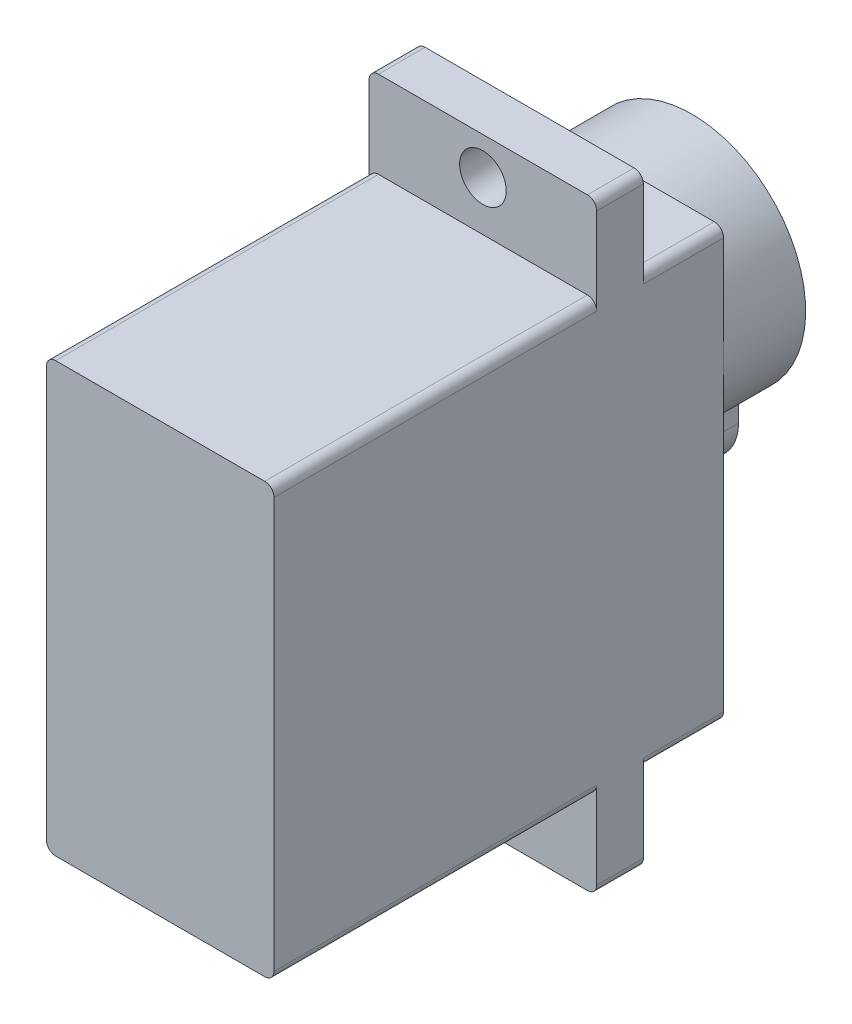
ISO-10303-21;
HEADER;
FILE_DESCRIPTION(('STEP AP214'),'2;1');
FILE_NAME('part.step','',(''),(''),'','','');
FILE_SCHEMA(('AUTOMOTIVE_DESIGN { 1 0 10303 214 1 1 1 1 }'));
ENDSEC;
DATA;
#1=APPLICATION_CONTEXT('core data for automotive mechanical design processes');
#2=APPLICATION_PROTOCOL_DEFINITION('international standard','automotive_design',2000,#1);
#3=PRODUCT_CONTEXT('',#1,'mechanical');
#4=PRODUCT('Part','Part','',(#3));
#5=PRODUCT_RELATED_PRODUCT_CATEGORY('part','',(#4));
#6=PRODUCT_DEFINITION_FORMATION('','',#4);
#7=PRODUCT_DEFINITION_CONTEXT('part definition',#1,'design');
#8=PRODUCT_DEFINITION('design','',#6,#7);
#9=PRODUCT_DEFINITION_SHAPE('','',#8);
#10=(LENGTH_UNIT() NAMED_UNIT(*) SI_UNIT(.MILLI.,.METRE.));
#11=(NAMED_UNIT(*) PLANE_ANGLE_UNIT() SI_UNIT($,.RADIAN.));
#12=(NAMED_UNIT(*) SI_UNIT($,.STERADIAN.) SOLID_ANGLE_UNIT());
#13=UNCERTAINTY_MEASURE_WITH_UNIT(LENGTH_MEASURE(1.E-05),#10,'distance_accuracy_value','');
#14=(GEOMETRIC_REPRESENTATION_CONTEXT(3) GLOBAL_UNCERTAINTY_ASSIGNED_CONTEXT((#13)) GLOBAL_UNIT_ASSIGNED_CONTEXT((#10,
#11,#12)) REPRESENTATION_CONTEXT('',''));
#15=CARTESIAN_POINT('',(0.,0.,0.));
#16=DIRECTION('',(0.,0.,1.));
#17=DIRECTION('',(1.,0.,0.));
#18=AXIS2_PLACEMENT_3D('',#15,#16,#17);
#19=CARTESIAN_POINT('',(5.6,-11.,-12.05));
#20=DIRECTION('',(0.,0.,1.));
#21=DIRECTION('',(1.,0.,0.));
#22=AXIS2_PLACEMENT_3D('',#19,#20,#21);
#23=PLANE('',#22);
#24=CARTESIAN_POINT('',(0.,5.4,-12.05));
#25=DIRECTION('',(0.,0.,-1.));
#26=DIRECTION('',(-1.,0.,0.));
#27=AXIS2_PLACEMENT_3D('',#24,#25,#26);
#28=CIRCLE('',#27,6.1);
#29=CARTESIAN_POINT('',(0.,11.5,-12.05));
#30=VERTEX_POINT('',#29);
#31=CARTESIAN_POINT('',(6.1,5.4,-12.05));
#32=VERTEX_POINT('',#31);
#33=EDGE_CURVE('E444',#30,#32,#28,.T.);
#34=ORIENTED_EDGE('',*,*,#33,.F.);
#35=DIRECTION('',(-1.,0.,0.));
#36=VECTOR('',#35,1.);
#37=CARTESIAN_POINT('',(-5.6,11.5,-12.05));
#38=LINE('',#37,#36);
#39=CARTESIAN_POINT('',(5.59999999999999,11.5,-12.05));
#40=VERTEX_POINT('',#39);
#41=EDGE_CURVE('E397',#40,#30,#38,.T.);
#42=ORIENTED_EDGE('',*,*,#41,.F.);
#43=CARTESIAN_POINT('',(5.6,11.,-12.05));
#44=DIRECTION('',(0.,0.,1.));
#45=DIRECTION('',(-1.,0.,0.));
#46=AXIS2_PLACEMENT_3D('',#43,#44,#45);
#47=CIRCLE('',#46,0.5);
#48=CARTESIAN_POINT('',(6.1,11.,-12.05));
#49=VERTEX_POINT('',#48);
#50=EDGE_CURVE('E393',#49,#40,#47,.T.);
#51=ORIENTED_EDGE('',*,*,#50,.F.);
#52=DIRECTION('',(0.,1.,0.));
#53=VECTOR('',#52,1.);
#54=CARTESIAN_POINT('',(6.1,-11.,-12.05));
#55=LINE('',#54,#53);
#56=EDGE_CURVE('E389',#32,#49,#55,.T.);
#57=ORIENTED_EDGE('',*,*,#56,.F.);
#58=EDGE_LOOP('',(#34,#42,#51,#57));
#59=FACE_BOUND('',#58,.T.);
#60=ADVANCED_FACE('F38',(#59),#23,.F.);
#61=CARTESIAN_POINT('',(2.5,-0.164171097297423,-12.05));
#62=VERTEX_POINT('',#61);
#63=EDGE_CURVE('E448',#32,#62,#28,.T.);
#64=ORIENTED_EDGE('',*,*,#63,.F.);
#65=CARTESIAN_POINT('',(6.1,-11.,-12.05));
#66=VERTEX_POINT('',#65);
#67=EDGE_CURVE('E390',#66,#32,#55,.T.);
#68=ORIENTED_EDGE('',*,*,#67,.F.);
#69=CARTESIAN_POINT('',(5.6,-11.,-12.05));
#70=DIRECTION('',(0.,0.,1.));
#71=DIRECTION('',(1.,0.,0.));
#72=AXIS2_PLACEMENT_3D('',#69,#70,#71);
#73=CIRCLE('',#72,0.5);
#74=CARTESIAN_POINT('',(5.59999999999999,-11.5,-12.05));
#75=VERTEX_POINT('',#74);
#76=EDGE_CURVE('E367',#75,#66,#73,.T.);
#77=ORIENTED_EDGE('',*,*,#76,.F.);
#78=DIRECTION('',(1.,0.,0.));
#79=VECTOR('',#78,1.);
#80=CARTESIAN_POINT('',(-5.6,-11.5,-12.05));
#81=LINE('',#80,#79);
#82=CARTESIAN_POINT('',(-5.6,-11.5,-12.05));
#83=VERTEX_POINT('',#82);
#84=EDGE_CURVE('E372',#83,#75,#81,.T.);
#85=ORIENTED_EDGE('',*,*,#84,.F.);
#86=CARTESIAN_POINT('',(-5.6,-11.,-12.05));
#87=DIRECTION('',(0.,0.,1.));
#88=DIRECTION('',(-1.,0.,0.));
#89=AXIS2_PLACEMENT_3D('',#86,#87,#88);
#90=CIRCLE('',#89,0.5);
#91=CARTESIAN_POINT('',(-6.1,-11.,-12.05));
#92=VERTEX_POINT('',#91);
#93=EDGE_CURVE('E407',#92,#83,#90,.T.);
#94=ORIENTED_EDGE('',*,*,#93,.F.);
#95=DIRECTION('',(0.,-1.,0.));
#96=VECTOR('',#95,1.);
#97=CARTESIAN_POINT('',(-6.1,-11.,-12.05));
#98=LINE('',#97,#96);
#99=CARTESIAN_POINT('',(-6.1,5.4,-12.05));
#100=VERTEX_POINT('',#99);
#101=EDGE_CURVE('E403',#100,#92,#98,.T.);
#102=ORIENTED_EDGE('',*,*,#101,.F.);
#103=CARTESIAN_POINT('',(-2.5,-0.164171097297423,-12.05));
#104=VERTEX_POINT('',#103);
#105=EDGE_CURVE('E450',#104,#100,#28,.T.);
#106=ORIENTED_EDGE('',*,*,#105,.F.);
#107=DIRECTION('',(0.,1.,0.));
#108=VECTOR('',#107,1.);
#109=CARTESIAN_POINT('',(-2.5,-1.6,-12.05));
#110=LINE('',#109,#108);
#111=CARTESIAN_POINT('',(-2.5,-1.6,-12.05));
#112=VERTEX_POINT('',#111);
#113=EDGE_CURVE('E456',#112,#104,#110,.T.);
#114=ORIENTED_EDGE('',*,*,#113,.F.);
#115=CARTESIAN_POINT('',(0.,-1.6,-12.05));
#116=DIRECTION('',(0.,0.,-1.));
#117=DIRECTION('',(-1.,0.,0.));
#118=AXIS2_PLACEMENT_3D('',#115,#116,#117);
#119=CIRCLE('',#118,2.5);
#120=CARTESIAN_POINT('',(2.5,-1.6,-12.05));
#121=VERTEX_POINT('',#120);
#122=EDGE_CURVE('E59',#121,#112,#119,.T.);
#123=ORIENTED_EDGE('',*,*,#122,.F.);
#124=DIRECTION('',(0.,-1.,0.));
#125=VECTOR('',#124,1.);
#126=CARTESIAN_POINT('',(2.5,-1.6,-12.05));
#127=LINE('',#126,#125);
#128=EDGE_CURVE('E54',#62,#121,#127,.T.);
#129=ORIENTED_EDGE('',*,*,#128,.F.);
#130=EDGE_LOOP('',(#64,#68,#77,#85,#94,#102,#106,#114,#123,#129));
#131=FACE_BOUND('',#130,.T.);
#132=ADVANCED_FACE('F465',(#131),#23,.F.);
#133=EDGE_CURVE('E442',#100,#30,#28,.T.);
#134=ORIENTED_EDGE('',*,*,#133,.F.);
#135=CARTESIAN_POINT('',(-6.1,11.,-12.05));
#136=VERTEX_POINT('',#135);
#137=EDGE_CURVE('E404',#136,#100,#98,.T.);
#138=ORIENTED_EDGE('',*,*,#137,.F.);
#139=CARTESIAN_POINT('',(-5.6,11.,-12.05));
#140=DIRECTION('',(0.,0.,1.));
#141=DIRECTION('',(-1.,0.,0.));
#142=AXIS2_PLACEMENT_3D('',#139,#140,#141);
#143=CIRCLE('',#142,0.5);
#144=CARTESIAN_POINT('',(-5.6,11.5,-12.05));
#145=VERTEX_POINT('',#144);
#146=EDGE_CURVE('E400',#145,#136,#143,.T.);
#147=ORIENTED_EDGE('',*,*,#146,.F.);
#148=EDGE_CURVE('E396',#30,#145,#38,.T.);
#149=ORIENTED_EDGE('',*,*,#148,.F.);
#150=EDGE_LOOP('',(#134,#138,#147,#149));
#151=FACE_BOUND('',#150,.T.);
#152=ADVANCED_FACE('F462',(#151),#23,.F.);
#153=CARTESIAN_POINT('',(5.6,-11.,12.05));
#154=DIRECTION('',(0.,0.,-1.));
#155=DIRECTION('',(-1.,0.,0.));
#156=AXIS2_PLACEMENT_3D('',#153,#154,#155);
#157=CYLINDRICAL_SURFACE('',#156,0.5);
#158=CARTESIAN_POINT('',(5.6,-11.,-5.25));
#159=DIRECTION('',(0.,0.,-1.));
#160=DIRECTION('',(-1.,0.,0.));
#161=AXIS2_PLACEMENT_3D('',#158,#159,#160);
#162=CIRCLE('',#161,0.5);
#163=CARTESIAN_POINT('',(6.1,-11.,-5.25));
#164=VERTEX_POINT('',#163);
#165=CARTESIAN_POINT('',(5.59999999999999,-11.5,-5.25));
#166=VERTEX_POINT('',#165);
#167=EDGE_CURVE('E279',#164,#166,#162,.T.);
#168=ORIENTED_EDGE('',*,*,#167,.F.);
#169=DIRECTION('',(0.,0.,-1.));
#170=VECTOR('',#169,1.);
#171=CARTESIAN_POINT('',(6.1,-11.,12.05));
#172=LINE('',#171,#170);
#173=CARTESIAN_POINT('',(6.1,-11.,12.05));
#174=VERTEX_POINT('',#173);
#175=EDGE_CURVE('E440',#174,#164,#172,.T.);
#176=ORIENTED_EDGE('',*,*,#175,.F.);
#177=CARTESIAN_POINT('',(5.6,-11.,12.05));
#178=DIRECTION('',(0.,0.,1.));
#179=DIRECTION('',(1.,0.,0.));
#180=AXIS2_PLACEMENT_3D('',#177,#178,#179);
#181=CIRCLE('',#180,0.5);
#182=CARTESIAN_POINT('',(5.59999999999999,-11.5,12.05));
#183=VERTEX_POINT('',#182);
#184=EDGE_CURVE('E368',#183,#174,#181,.T.);
#185=ORIENTED_EDGE('',*,*,#184,.F.);
#186=DIRECTION('',(0.,0.,-1.));
#187=VECTOR('',#186,1.);
#188=CARTESIAN_POINT('',(5.59999999999999,-11.5,12.05));
#189=LINE('',#188,#187);
#190=EDGE_CURVE('E412',#183,#166,#189,.T.);
#191=ORIENTED_EDGE('',*,*,#190,.T.);
#192=EDGE_LOOP('',(#168,#176,#185,#191));
#193=FACE_BOUND('',#192,.T.);
#194=ADVANCED_FACE('F576',(#193),#157,.T.);
#195=CARTESIAN_POINT('',(-5.6,-11.,12.05));
#196=DIRECTION('',(0.,0.,-1.));
#197=DIRECTION('',(-1.,0.,0.));
#198=AXIS2_PLACEMENT_3D('',#195,#196,#197);
#199=CYLINDRICAL_SURFACE('',#198,0.5);
#200=CARTESIAN_POINT('',(-5.6,-11.,-5.25));
#201=DIRECTION('',(0.,0.,-1.));
#202=DIRECTION('',(-1.,0.,0.));
#203=AXIS2_PLACEMENT_3D('',#200,#201,#202);
#204=CIRCLE('',#203,0.5);
#205=CARTESIAN_POINT('',(-5.6,-11.5,-5.25));
#206=VERTEX_POINT('',#205);
#207=CARTESIAN_POINT('',(-6.1,-11.,-5.25));
#208=VERTEX_POINT('',#207);
#209=EDGE_CURVE('E265',#206,#208,#204,.T.);
#210=ORIENTED_EDGE('',*,*,#209,.F.);
#211=DIRECTION('',(0.,0.,-1.));
#212=VECTOR('',#211,1.);
#213=CARTESIAN_POINT('',(-5.6,-11.5,12.05));
#214=LINE('',#213,#212);
#215=CARTESIAN_POINT('',(-5.6,-11.5,12.05));
#216=VERTEX_POINT('',#215);
#217=EDGE_CURVE('E416',#216,#206,#214,.T.);
#218=ORIENTED_EDGE('',*,*,#217,.F.);
#219=CARTESIAN_POINT('',(-5.6,-11.,12.05));
#220=DIRECTION('',(0.,0.,1.));
#221=DIRECTION('',(-1.,0.,0.));
#222=AXIS2_PLACEMENT_3D('',#219,#220,#221);
#223=CIRCLE('',#222,0.5);
#224=CARTESIAN_POINT('',(-6.1,-11.,12.05));
#225=VERTEX_POINT('',#224);
#226=EDGE_CURVE('E382',#225,#216,#223,.T.);
#227=ORIENTED_EDGE('',*,*,#226,.F.);
#228=DIRECTION('',(0.,0.,-1.));
#229=VECTOR('',#228,1.);
#230=CARTESIAN_POINT('',(-6.1,-11.,12.05));
#231=LINE('',#230,#229);
#232=EDGE_CURVE('E420',#225,#208,#231,.T.);
#233=ORIENTED_EDGE('',*,*,#232,.T.);
#234=EDGE_LOOP('',(#210,#218,#227,#233));
#235=FACE_BOUND('',#234,.T.);
#236=ADVANCED_FACE('F531',(#235),#199,.T.);
#237=CARTESIAN_POINT('',(-5.6,-11.5,12.05));
#238=DIRECTION('',(0.,1.,0.));
#239=DIRECTION('',(0.,0.,1.));
#240=AXIS2_PLACEMENT_3D('',#237,#238,#239);
#241=PLANE('',#240);
#242=DIRECTION('',(-1.,0.,0.));
#243=VECTOR('',#242,1.);
#244=CARTESIAN_POINT('',(5.59999999999999,-11.5,-5.25));
#245=LINE('',#244,#243);
#246=EDGE_CURVE('E281',#166,#206,#245,.T.);
#247=ORIENTED_EDGE('',*,*,#246,.F.);
#248=ORIENTED_EDGE('',*,*,#190,.F.);
#249=DIRECTION('',(1.,0.,0.));
#250=VECTOR('',#249,1.);
#251=CARTESIAN_POINT('',(-5.6,-11.5,12.05));
#252=LINE('',#251,#250);
#253=EDGE_CURVE('E384',#216,#183,#252,.T.);
#254=ORIENTED_EDGE('',*,*,#253,.F.);
#255=ORIENTED_EDGE('',*,*,#217,.T.);
#256=EDGE_LOOP('',(#247,#248,#254,#255));
#257=FACE_BOUND('',#256,.T.);
#258=ADVANCED_FACE('F579',(#257),#241,.F.);
#259=CARTESIAN_POINT('',(5.6,11.,12.05));
#260=DIRECTION('',(0.,0.,-1.));
#261=DIRECTION('',(-1.,0.,0.));
#262=AXIS2_PLACEMENT_3D('',#259,#260,#261);
#263=CYLINDRICAL_SURFACE('',#262,0.5);
#264=CARTESIAN_POINT('',(5.6,11.,-7.75));
#265=DIRECTION('',(0.,0.,-1.));
#266=DIRECTION('',(1.,0.,0.));
#267=AXIS2_PLACEMENT_3D('',#264,#265,#266);
#268=CIRCLE('',#267,0.5);
#269=CARTESIAN_POINT('',(5.59999999999999,11.5,-7.75));
#270=VERTEX_POINT('',#269);
#271=CARTESIAN_POINT('',(6.1,11.,-7.75));
#272=VERTEX_POINT('',#271);
#273=EDGE_CURVE('E316',#270,#272,#268,.T.);
#274=ORIENTED_EDGE('',*,*,#273,.T.);
#275=DIRECTION('',(0.,0.,-1.));
#276=VECTOR('',#275,1.);
#277=CARTESIAN_POINT('',(6.1,11.,12.05));
#278=LINE('',#277,#276);
#279=EDGE_CURVE('E435',#272,#49,#278,.T.);
#280=ORIENTED_EDGE('',*,*,#279,.T.);
#281=ORIENTED_EDGE('',*,*,#50,.T.);
#282=DIRECTION('',(0.,0.,-1.));
#283=VECTOR('',#282,1.);
#284=CARTESIAN_POINT('',(5.59999999999999,11.5,12.05));
#285=LINE('',#284,#283);
#286=EDGE_CURVE('E431',#270,#40,#285,.T.);
#287=ORIENTED_EDGE('',*,*,#286,.F.);
#288=EDGE_LOOP('',(#274,#280,#281,#287));
#289=FACE_BOUND('',#288,.T.);
#290=ADVANCED_FACE('F561',(#289),#263,.T.);
#291=CARTESIAN_POINT('',(-5.6,11.5,12.05));
#292=DIRECTION('',(0.,-1.,0.));
#293=DIRECTION('',(0.,0.,-1.));
#294=AXIS2_PLACEMENT_3D('',#291,#292,#293);
#295=PLANE('',#294);
#296=DIRECTION('',(1.,0.,0.));
#297=VECTOR('',#296,1.);
#298=CARTESIAN_POINT('',(5.59999999999999,11.5,-7.75));
#299=LINE('',#298,#297);
#300=CARTESIAN_POINT('',(-5.6,11.5,-7.75));
#301=VERTEX_POINT('',#300);
#302=EDGE_CURVE('E323',#301,#270,#299,.T.);
#303=ORIENTED_EDGE('',*,*,#302,.T.);
#304=ORIENTED_EDGE('',*,*,#286,.T.);
#305=ORIENTED_EDGE('',*,*,#41,.T.);
#306=ORIENTED_EDGE('',*,*,#148,.T.);
#307=DIRECTION('',(0.,0.,-1.));
#308=VECTOR('',#307,1.);
#309=CARTESIAN_POINT('',(-5.6,11.5,12.05));
#310=LINE('',#309,#308);
#311=EDGE_CURVE('E427',#301,#145,#310,.T.);
#312=ORIENTED_EDGE('',*,*,#311,.F.);
#313=EDGE_LOOP('',(#303,#304,#305,#306,#312));
#314=FACE_BOUND('',#313,.T.);
#315=ADVANCED_FACE('F478',(#314),#295,.F.);
#316=CARTESIAN_POINT('',(-5.6,11.,12.05));
#317=DIRECTION('',(0.,0.,-1.));
#318=DIRECTION('',(-1.,0.,0.));
#319=AXIS2_PLACEMENT_3D('',#316,#317,#318);
#320=CYLINDRICAL_SURFACE('',#319,0.5);
#321=CARTESIAN_POINT('',(-5.6,11.,-7.75));
#322=DIRECTION('',(0.,0.,-1.));
#323=DIRECTION('',(1.,0.,0.));
#324=AXIS2_PLACEMENT_3D('',#321,#322,#323);
#325=CIRCLE('',#324,0.5);
#326=CARTESIAN_POINT('',(-6.1,11.,-7.75));
#327=VERTEX_POINT('',#326);
#328=EDGE_CURVE('E351',#327,#301,#325,.T.);
#329=ORIENTED_EDGE('',*,*,#328,.T.);
#330=ORIENTED_EDGE('',*,*,#311,.T.);
#331=ORIENTED_EDGE('',*,*,#146,.T.);
#332=DIRECTION('',(0.,0.,-1.));
#333=VECTOR('',#332,1.);
#334=CARTESIAN_POINT('',(-6.1,11.,12.05));
#335=LINE('',#334,#333);
#336=EDGE_CURVE('E423',#327,#136,#335,.T.);
#337=ORIENTED_EDGE('',*,*,#336,.F.);
#338=EDGE_LOOP('',(#329,#330,#331,#337));
#339=FACE_BOUND('',#338,.T.);
#340=ADVANCED_FACE('F475',(#339),#320,.T.);
#341=CARTESIAN_POINT('',(6.1,-11.,-7.75));
#342=VERTEX_POINT('',#341);
#343=EDGE_CURVE('E439',#342,#66,#172,.T.);
#344=ORIENTED_EDGE('',*,*,#343,.F.);
#345=CARTESIAN_POINT('',(5.6,-11.,-7.75));
#346=DIRECTION('',(0.,0.,-1.));
#347=DIRECTION('',(-1.,0.,0.));
#348=AXIS2_PLACEMENT_3D('',#345,#346,#347);
#349=CIRCLE('',#348,0.5);
#350=CARTESIAN_POINT('',(5.59999999999999,-11.5,-7.75));
#351=VERTEX_POINT('',#350);
#352=EDGE_CURVE('E296',#342,#351,#349,.T.);
#353=ORIENTED_EDGE('',*,*,#352,.T.);
#354=EDGE_CURVE('E386',#351,#75,#189,.T.);
#355=ORIENTED_EDGE('',*,*,#354,.T.);
#356=ORIENTED_EDGE('',*,*,#76,.T.);
#357=EDGE_LOOP('',(#344,#353,#355,#356));
#358=FACE_BOUND('',#357,.T.);
#359=ADVANCED_FACE('F492',(#358),#157,.T.);
#360=CARTESIAN_POINT('',(6.1,-11.,12.05));
#361=DIRECTION('',(-1.,0.,0.));
#362=DIRECTION('',(0.,0.,1.));
#363=AXIS2_PLACEMENT_3D('',#360,#361,#362);
#364=PLANE('',#363);
#365=ORIENTED_EDGE('',*,*,#67,.T.);
#366=ORIENTED_EDGE('',*,*,#56,.T.);
#367=ORIENTED_EDGE('',*,*,#279,.F.);
#368=DIRECTION('',(0.,1.,0.));
#369=VECTOR('',#368,1.);
#370=CARTESIAN_POINT('',(6.1,11.,-7.75));
#371=LINE('',#370,#369);
#372=CARTESIAN_POINT('',(6.1,15.65,-7.75));
#373=VERTEX_POINT('',#372);
#374=EDGE_CURVE('E340',#272,#373,#371,.T.);
#375=ORIENTED_EDGE('',*,*,#374,.T.);
#376=DIRECTION('',(0.,0.,-1.));
#377=VECTOR('',#376,1.);
#378=CARTESIAN_POINT('',(6.1,15.65,-5.25));
#379=LINE('',#378,#377);
#380=CARTESIAN_POINT('',(6.1,15.65,-5.25));
#381=VERTEX_POINT('',#380);
#382=EDGE_CURVE('E364',#381,#373,#379,.T.);
#383=ORIENTED_EDGE('',*,*,#382,.F.);
#384=DIRECTION('',(0.,1.,0.));
#385=VECTOR('',#384,1.);
#386=CARTESIAN_POINT('',(6.1,11.,-5.25));
#387=LINE('',#386,#385);
#388=CARTESIAN_POINT('',(6.1,11.,-5.25));
#389=VERTEX_POINT('',#388);
#390=EDGE_CURVE('E322',#389,#381,#387,.T.);
#391=ORIENTED_EDGE('',*,*,#390,.F.);
#392=CARTESIAN_POINT('',(6.1,11.,12.05));
#393=VERTEX_POINT('',#392);
#394=EDGE_CURVE('E436',#393,#389,#278,.T.);
#395=ORIENTED_EDGE('',*,*,#394,.F.);
#396=DIRECTION('',(0.,1.,0.));
#397=VECTOR('',#396,1.);
#398=CARTESIAN_POINT('',(6.1,-11.,12.05));
#399=LINE('',#398,#397);
#400=EDGE_CURVE('E371',#174,#393,#399,.T.);
#401=ORIENTED_EDGE('',*,*,#400,.F.);
#402=ORIENTED_EDGE('',*,*,#175,.T.);
#403=DIRECTION('',(0.,1.,0.));
#404=VECTOR('',#403,1.);
#405=CARTESIAN_POINT('',(6.1,-11.,-5.25));
#406=LINE('',#405,#404);
#407=CARTESIAN_POINT('',(6.1,-15.65,-5.25));
#408=VERTEX_POINT('',#407);
#409=EDGE_CURVE('E277',#408,#164,#406,.T.);
#410=ORIENTED_EDGE('',*,*,#409,.F.);
#411=DIRECTION('',(0.,0.,-1.));
#412=VECTOR('',#411,1.);
#413=CARTESIAN_POINT('',(6.1,-15.65,-5.25));
#414=LINE('',#413,#412);
#415=CARTESIAN_POINT('',(6.1,-15.65,-7.75));
#416=VERTEX_POINT('',#415);
#417=EDGE_CURVE('E283',#408,#416,#414,.T.);
#418=ORIENTED_EDGE('',*,*,#417,.T.);
#419=DIRECTION('',(0.,1.,0.));
#420=VECTOR('',#419,1.);
#421=CARTESIAN_POINT('',(6.1,-11.,-7.75));
#422=LINE('',#421,#420);
#423=EDGE_CURVE('E294',#416,#342,#422,.T.);
#424=ORIENTED_EDGE('',*,*,#423,.T.);
#425=ORIENTED_EDGE('',*,*,#343,.T.);
#426=EDGE_LOOP('',(#365,#366,#367,#375,#383,#391,#395,#401,#402,#410,#418,#424,#425));
#427=FACE_BOUND('',#426,.T.);
#428=ADVANCED_FACE('F488',(#427),#364,.F.);
#429=ORIENTED_EDGE('',*,*,#394,.T.);
#430=CARTESIAN_POINT('',(5.6,11.,-5.25));
#431=DIRECTION('',(0.,0.,-1.));
#432=DIRECTION('',(1.,0.,0.));
#433=AXIS2_PLACEMENT_3D('',#430,#431,#432);
#434=CIRCLE('',#433,0.5);
#435=CARTESIAN_POINT('',(5.59999999999999,11.5,-5.25));
#436=VERTEX_POINT('',#435);
#437=EDGE_CURVE('E319',#436,#389,#434,.T.);
#438=ORIENTED_EDGE('',*,*,#437,.F.);
#439=CARTESIAN_POINT('',(5.59999999999999,11.5,12.05));
#440=VERTEX_POINT('',#439);
#441=EDGE_CURVE('E432',#440,#436,#285,.T.);
#442=ORIENTED_EDGE('',*,*,#441,.F.);
#443=CARTESIAN_POINT('',(5.6,11.,12.05));
#444=DIRECTION('',(0.,0.,1.));
#445=DIRECTION('',(-1.,0.,0.));
#446=AXIS2_PLACEMENT_3D('',#443,#444,#445);
#447=CIRCLE('',#446,0.5);
#448=EDGE_CURVE('E374',#393,#440,#447,.T.);
#449=ORIENTED_EDGE('',*,*,#448,.F.);
#450=EDGE_LOOP('',(#429,#438,#442,#449));
#451=FACE_BOUND('',#450,.T.);
#452=ADVANCED_FACE('F572',(#451),#263,.T.);
#453=ORIENTED_EDGE('',*,*,#441,.T.);
#454=DIRECTION('',(1.,0.,0.));
#455=VECTOR('',#454,1.);
#456=CARTESIAN_POINT('',(5.59999999999999,11.5,-5.25));
#457=LINE('',#456,#455);
#458=CARTESIAN_POINT('',(-5.6,11.5,-5.25));
#459=VERTEX_POINT('',#458);
#460=EDGE_CURVE('E335',#459,#436,#457,.T.);
#461=ORIENTED_EDGE('',*,*,#460,.F.);
#462=CARTESIAN_POINT('',(-5.6,11.5,12.05));
#463=VERTEX_POINT('',#462);
#464=EDGE_CURVE('E428',#463,#459,#310,.T.);
#465=ORIENTED_EDGE('',*,*,#464,.F.);
#466=DIRECTION('',(-1.,0.,0.));
#467=VECTOR('',#466,1.);
#468=CARTESIAN_POINT('',(-5.6,11.5,12.05));
#469=LINE('',#468,#467);
#470=EDGE_CURVE('E376',#440,#463,#469,.T.);
#471=ORIENTED_EDGE('',*,*,#470,.F.);
#472=EDGE_LOOP('',(#453,#461,#465,#471));
#473=FACE_BOUND('',#472,.T.);
#474=ADVANCED_FACE('F612',(#473),#295,.F.);
#475=ORIENTED_EDGE('',*,*,#464,.T.);
#476=CARTESIAN_POINT('',(-5.6,11.,-5.25));
#477=DIRECTION('',(0.,0.,-1.));
#478=DIRECTION('',(1.,0.,0.));
#479=AXIS2_PLACEMENT_3D('',#476,#477,#478);
#480=CIRCLE('',#479,0.5);
#481=CARTESIAN_POINT('',(-6.1,11.,-5.25));
#482=VERTEX_POINT('',#481);
#483=EDGE_CURVE('E333',#482,#459,#480,.T.);
#484=ORIENTED_EDGE('',*,*,#483,.F.);
#485=CARTESIAN_POINT('',(-6.1,11.,12.05));
#486=VERTEX_POINT('',#485);
#487=EDGE_CURVE('E424',#486,#482,#335,.T.);
#488=ORIENTED_EDGE('',*,*,#487,.F.);
#489=CARTESIAN_POINT('',(-5.6,11.,12.05));
#490=DIRECTION('',(0.,0.,1.));
#491=DIRECTION('',(-1.,0.,0.));
#492=AXIS2_PLACEMENT_3D('',#489,#490,#491);
#493=CIRCLE('',#492,0.5);
#494=EDGE_CURVE('E378',#463,#486,#493,.T.);
#495=ORIENTED_EDGE('',*,*,#494,.F.);
#496=EDGE_LOOP('',(#475,#484,#488,#495));
#497=FACE_BOUND('',#496,.T.);
#498=ADVANCED_FACE('F542',(#497),#320,.T.);
#499=CARTESIAN_POINT('',(-6.1,-11.,12.05));
#500=DIRECTION('',(1.,0.,0.));
#501=DIRECTION('',(0.,0.,-1.));
#502=AXIS2_PLACEMENT_3D('',#499,#500,#501);
#503=PLANE('',#502);
#504=ORIENTED_EDGE('',*,*,#137,.T.);
#505=ORIENTED_EDGE('',*,*,#101,.T.);
#506=CARTESIAN_POINT('',(-6.1,-11.,-7.75));
#507=VERTEX_POINT('',#506);
#508=EDGE_CURVE('E419',#507,#92,#231,.T.);
#509=ORIENTED_EDGE('',*,*,#508,.F.);
#510=DIRECTION('',(0.,-1.,0.));
#511=VECTOR('',#510,1.);
#512=CARTESIAN_POINT('',(-6.1,-11.,-7.75));
#513=LINE('',#512,#511);
#514=CARTESIAN_POINT('',(-6.1,-15.65,-7.75));
#515=VERTEX_POINT('',#514);
#516=EDGE_CURVE('E286',#507,#515,#513,.T.);
#517=ORIENTED_EDGE('',*,*,#516,.T.);
#518=DIRECTION('',(0.,0.,-1.));
#519=VECTOR('',#518,1.);
#520=CARTESIAN_POINT('',(-6.1,-15.65,-5.25));
#521=LINE('',#520,#519);
#522=CARTESIAN_POINT('',(-6.1,-15.65,-5.25));
#523=VERTEX_POINT('',#522);
#524=EDGE_CURVE('E309',#523,#515,#521,.T.);
#525=ORIENTED_EDGE('',*,*,#524,.F.);
#526=DIRECTION('',(0.,-1.,0.));
#527=VECTOR('',#526,1.);
#528=CARTESIAN_POINT('',(-6.1,-11.,-5.25));
#529=LINE('',#528,#527);
#530=EDGE_CURVE('E268',#208,#523,#529,.T.);
#531=ORIENTED_EDGE('',*,*,#530,.F.);
#532=ORIENTED_EDGE('',*,*,#232,.F.);
#533=DIRECTION('',(0.,-1.,0.));
#534=VECTOR('',#533,1.);
#535=CARTESIAN_POINT('',(-6.1,-11.,12.05));
#536=LINE('',#535,#534);
#537=EDGE_CURVE('E380',#486,#225,#536,.T.);
#538=ORIENTED_EDGE('',*,*,#537,.F.);
#539=ORIENTED_EDGE('',*,*,#487,.T.);
#540=DIRECTION('',(0.,-1.,0.));
#541=VECTOR('',#540,1.);
#542=CARTESIAN_POINT('',(-6.1,11.,-5.25));
#543=LINE('',#542,#541);
#544=CARTESIAN_POINT('',(-6.1,15.65,-5.25));
#545=VERTEX_POINT('',#544);
#546=EDGE_CURVE('E331',#545,#482,#543,.T.);
#547=ORIENTED_EDGE('',*,*,#546,.F.);
#548=DIRECTION('',(0.,0.,-1.));
#549=VECTOR('',#548,1.);
#550=CARTESIAN_POINT('',(-6.1,15.65,-5.25));
#551=LINE('',#550,#549);
#552=CARTESIAN_POINT('',(-6.1,15.65,-7.75));
#553=VERTEX_POINT('',#552);
#554=EDGE_CURVE('E337',#545,#553,#551,.T.);
#555=ORIENTED_EDGE('',*,*,#554,.T.);
#556=DIRECTION('',(0.,-1.,0.));
#557=VECTOR('',#556,1.);
#558=CARTESIAN_POINT('',(-6.1,11.,-7.75));
#559=LINE('',#558,#557);
#560=EDGE_CURVE('E348',#553,#327,#559,.T.);
#561=ORIENTED_EDGE('',*,*,#560,.T.);
#562=ORIENTED_EDGE('',*,*,#336,.T.);
#563=EDGE_LOOP('',(#504,#505,#509,#517,#525,#531,#532,#538,#539,#547,#555,#561,#562));
#564=FACE_BOUND('',#563,.T.);
#565=ADVANCED_FACE('F470',(#564),#503,.F.);
#566=CARTESIAN_POINT('',(-5.6,-11.5,-7.75));
#567=VERTEX_POINT('',#566);
#568=EDGE_CURVE('E415',#567,#83,#214,.T.);
#569=ORIENTED_EDGE('',*,*,#568,.F.);
#570=CARTESIAN_POINT('',(-5.6,-11.,-7.75));
#571=DIRECTION('',(0.,0.,-1.));
#572=DIRECTION('',(-1.,0.,0.));
#573=AXIS2_PLACEMENT_3D('',#570,#571,#572);
#574=CIRCLE('',#573,0.5);
#575=EDGE_CURVE('E263',#567,#507,#574,.T.);
#576=ORIENTED_EDGE('',*,*,#575,.T.);
#577=ORIENTED_EDGE('',*,*,#508,.T.);
#578=ORIENTED_EDGE('',*,*,#93,.T.);
#579=EDGE_LOOP('',(#569,#576,#577,#578));
#580=FACE_BOUND('',#579,.T.);
#581=ADVANCED_FACE('F499',(#580),#199,.T.);
#582=ORIENTED_EDGE('',*,*,#354,.F.);
#583=DIRECTION('',(-1.,0.,0.));
#584=VECTOR('',#583,1.);
#585=CARTESIAN_POINT('',(5.59999999999999,-11.5,-7.75));
#586=LINE('',#585,#584);
#587=EDGE_CURVE('E269',#351,#567,#586,.T.);
#588=ORIENTED_EDGE('',*,*,#587,.T.);
#589=ORIENTED_EDGE('',*,*,#568,.T.);
#590=ORIENTED_EDGE('',*,*,#84,.T.);
#591=EDGE_LOOP('',(#582,#588,#589,#590));
#592=FACE_BOUND('',#591,.T.);
#593=ADVANCED_FACE('F496',(#592),#241,.F.);
#594=CARTESIAN_POINT('',(5.6,-11.,12.05));
#595=DIRECTION('',(0.,0.,1.));
#596=DIRECTION('',(1.,0.,0.));
#597=AXIS2_PLACEMENT_3D('',#594,#595,#596);
#598=PLANE('',#597);
#599=ORIENTED_EDGE('',*,*,#184,.T.);
#600=ORIENTED_EDGE('',*,*,#400,.T.);
#601=ORIENTED_EDGE('',*,*,#448,.T.);
#602=ORIENTED_EDGE('',*,*,#470,.T.);
#603=ORIENTED_EDGE('',*,*,#494,.T.);
#604=ORIENTED_EDGE('',*,*,#537,.T.);
#605=ORIENTED_EDGE('',*,*,#226,.T.);
#606=ORIENTED_EDGE('',*,*,#253,.T.);
#607=EDGE_LOOP('',(#599,#600,#601,#602,#603,#604,#605,#606));
#608=FACE_BOUND('',#607,.T.);
#609=ADVANCED_FACE('F534',(#608),#598,.T.);
#610=CARTESIAN_POINT('',(5.6,11.,-5.25));
#611=DIRECTION('',(0.,0.,1.));
#612=DIRECTION('',(1.,0.,0.));
#613=AXIS2_PLACEMENT_3D('',#610,#611,#612);
#614=PLANE('',#613);
#615=ORIENTED_EDGE('',*,*,#437,.T.);
#616=ORIENTED_EDGE('',*,*,#390,.T.);
#617=CARTESIAN_POINT('',(5.6,15.65,-5.25));
#618=DIRECTION('',(0.,0.,1.));
#619=DIRECTION('',(1.,0.,0.));
#620=AXIS2_PLACEMENT_3D('',#617,#618,#619);
#621=CIRCLE('',#620,0.5);
#622=CARTESIAN_POINT('',(5.59999999999999,16.15,-5.25));
#623=VERTEX_POINT('',#622);
#624=EDGE_CURVE('E325',#381,#623,#621,.T.);
#625=ORIENTED_EDGE('',*,*,#624,.T.);
#626=DIRECTION('',(-1.,0.,0.));
#627=VECTOR('',#626,1.);
#628=CARTESIAN_POINT('',(-5.6,16.15,-5.25));
#629=LINE('',#628,#627);
#630=CARTESIAN_POINT('',(-5.6,16.15,-5.25));
#631=VERTEX_POINT('',#630);
#632=EDGE_CURVE('E327',#623,#631,#629,.T.);
#633=ORIENTED_EDGE('',*,*,#632,.T.);
#634=CARTESIAN_POINT('',(-5.6,15.65,-5.25));
#635=DIRECTION('',(0.,0.,1.));
#636=DIRECTION('',(-1.,0.,0.));
#637=AXIS2_PLACEMENT_3D('',#634,#635,#636);
#638=CIRCLE('',#637,0.5);
#639=EDGE_CURVE('E329',#631,#545,#638,.T.);
#640=ORIENTED_EDGE('',*,*,#639,.T.);
#641=ORIENTED_EDGE('',*,*,#546,.T.);
#642=ORIENTED_EDGE('',*,*,#483,.T.);
#643=ORIENTED_EDGE('',*,*,#460,.T.);
#644=EDGE_LOOP('',(#615,#616,#625,#633,#640,#641,#642,#643));
#645=FACE_BOUND('',#644,.T.);
#646=CARTESIAN_POINT('',(0.,14.15,-5.25));
#647=DIRECTION('',(0.,0.,1.));
#648=DIRECTION('',(1.,0.,0.));
#649=AXIS2_PLACEMENT_3D('',#646,#647,#648);
#650=CIRCLE('',#649,1.25);
#651=CARTESIAN_POINT('',(1.25,14.15,-5.25));
#652=VERTEX_POINT('',#651);
#653=EDGE_CURVE('E313',#652,#652,#650,.T.);
#654=ORIENTED_EDGE('',*,*,#653,.F.);
#655=EDGE_LOOP('',(#654));
#656=FACE_BOUND('',#655,.T.);
#657=ADVANCED_FACE('F546',(#645,#656),#614,.T.);
#658=CARTESIAN_POINT('',(5.6,11.,-7.75));
#659=DIRECTION('',(0.,0.,1.));
#660=DIRECTION('',(1.,0.,0.));
#661=AXIS2_PLACEMENT_3D('',#658,#659,#660);
#662=PLANE('',#661);
#663=ORIENTED_EDGE('',*,*,#273,.F.);
#664=ORIENTED_EDGE('',*,*,#302,.F.);
#665=ORIENTED_EDGE('',*,*,#328,.F.);
#666=ORIENTED_EDGE('',*,*,#560,.F.);
#667=CARTESIAN_POINT('',(-5.6,15.65,-7.75));
#668=DIRECTION('',(0.,0.,1.));
#669=DIRECTION('',(-1.,0.,0.));
#670=AXIS2_PLACEMENT_3D('',#667,#668,#669);
#671=CIRCLE('',#670,0.5);
#672=CARTESIAN_POINT('',(-5.6,16.15,-7.75));
#673=VERTEX_POINT('',#672);
#674=EDGE_CURVE('E346',#673,#553,#671,.T.);
#675=ORIENTED_EDGE('',*,*,#674,.F.);
#676=DIRECTION('',(-1.,0.,0.));
#677=VECTOR('',#676,1.);
#678=CARTESIAN_POINT('',(-5.6,16.15,-7.75));
#679=LINE('',#678,#677);
#680=CARTESIAN_POINT('',(5.59999999999999,16.15,-7.75));
#681=VERTEX_POINT('',#680);
#682=EDGE_CURVE('E344',#681,#673,#679,.T.);
#683=ORIENTED_EDGE('',*,*,#682,.F.);
#684=CARTESIAN_POINT('',(5.6,15.65,-7.75));
#685=DIRECTION('',(0.,0.,1.));
#686=DIRECTION('',(1.,0.,0.));
#687=AXIS2_PLACEMENT_3D('',#684,#685,#686);
#688=CIRCLE('',#687,0.5);
#689=EDGE_CURVE('E342',#373,#681,#688,.T.);
#690=ORIENTED_EDGE('',*,*,#689,.F.);
#691=ORIENTED_EDGE('',*,*,#374,.F.);
#692=EDGE_LOOP('',(#663,#664,#665,#666,#675,#683,#690,#691));
#693=FACE_BOUND('',#692,.T.);
#694=CARTESIAN_POINT('',(0.,14.15,-7.75));
#695=DIRECTION('',(0.,0.,1.));
#696=DIRECTION('',(1.,0.,0.));
#697=AXIS2_PLACEMENT_3D('',#694,#695,#696);
#698=CIRCLE('',#697,1.25);
#699=CARTESIAN_POINT('',(1.25,14.15,-7.75));
#700=VERTEX_POINT('',#699);
#701=EDGE_CURVE('E312',#700,#700,#698,.T.);
#702=ORIENTED_EDGE('',*,*,#701,.T.);
#703=EDGE_LOOP('',(#702));
#704=FACE_BOUND('',#703,.T.);
#705=ADVANCED_FACE('F557',(#693,#704),#662,.F.);
#706=CARTESIAN_POINT('',(5.6,15.65,-5.25));
#707=DIRECTION('',(0.,0.,-1.));
#708=DIRECTION('',(-1.,0.,0.));
#709=AXIS2_PLACEMENT_3D('',#706,#707,#708);
#710=CYLINDRICAL_SURFACE('',#709,0.5);
#711=ORIENTED_EDGE('',*,*,#689,.T.);
#712=DIRECTION('',(0.,0.,-1.));
#713=VECTOR('',#712,1.);
#714=CARTESIAN_POINT('',(5.59999999999999,16.15,-5.25));
#715=LINE('',#714,#713);
#716=EDGE_CURVE('E361',#623,#681,#715,.T.);
#717=ORIENTED_EDGE('',*,*,#716,.F.);
#718=ORIENTED_EDGE('',*,*,#624,.F.);
#719=ORIENTED_EDGE('',*,*,#382,.T.);
#720=EDGE_LOOP('',(#711,#717,#718,#719));
#721=FACE_BOUND('',#720,.T.);
#722=ADVANCED_FACE('F565',(#721),#710,.T.);
#723=CARTESIAN_POINT('',(-5.6,16.15,-5.25));
#724=DIRECTION('',(0.,-1.,0.));
#725=DIRECTION('',(0.,0.,-1.));
#726=AXIS2_PLACEMENT_3D('',#723,#724,#725);
#727=PLANE('',#726);
#728=ORIENTED_EDGE('',*,*,#682,.T.);
#729=DIRECTION('',(0.,0.,-1.));
#730=VECTOR('',#729,1.);
#731=CARTESIAN_POINT('',(-5.6,16.15,-5.25));
#732=LINE('',#731,#730);
#733=EDGE_CURVE('E358',#631,#673,#732,.T.);
#734=ORIENTED_EDGE('',*,*,#733,.F.);
#735=ORIENTED_EDGE('',*,*,#632,.F.);
#736=ORIENTED_EDGE('',*,*,#716,.T.);
#737=EDGE_LOOP('',(#728,#734,#735,#736));
#738=FACE_BOUND('',#737,.T.);
#739=ADVANCED_FACE('F762',(#738),#727,.F.);
#740=CARTESIAN_POINT('',(-5.6,15.65,-5.25));
#741=DIRECTION('',(0.,0.,-1.));
#742=DIRECTION('',(-1.,0.,0.));
#743=AXIS2_PLACEMENT_3D('',#740,#741,#742);
#744=CYLINDRICAL_SURFACE('',#743,0.5);
#745=ORIENTED_EDGE('',*,*,#674,.T.);
#746=ORIENTED_EDGE('',*,*,#554,.F.);
#747=ORIENTED_EDGE('',*,*,#639,.F.);
#748=ORIENTED_EDGE('',*,*,#733,.T.);
#749=EDGE_LOOP('',(#745,#746,#747,#748));
#750=FACE_BOUND('',#749,.T.);
#751=ADVANCED_FACE('F553',(#750),#744,.T.);
#752=CARTESIAN_POINT('',(0.,14.15,-5.25));
#753=DIRECTION('',(0.,0.,-1.));
#754=DIRECTION('',(-1.,0.,0.));
#755=AXIS2_PLACEMENT_3D('',#752,#753,#754);
#756=CYLINDRICAL_SURFACE('',#755,1.25);
#757=ORIENTED_EDGE('',*,*,#653,.T.);
#758=EDGE_LOOP('',(#757));
#759=FACE_BOUND('',#758,.T.);
#760=ORIENTED_EDGE('',*,*,#701,.F.);
#761=EDGE_LOOP('',(#760));
#762=FACE_BOUND('',#761,.T.);
#763=ADVANCED_FACE('F744',(#759,#762),#756,.F.);
#764=CARTESIAN_POINT('',(-5.6,-11.,-5.25));
#765=DIRECTION('',(0.,0.,-1.));
#766=DIRECTION('',(-1.,0.,0.));
#767=AXIS2_PLACEMENT_3D('',#764,#765,#766);
#768=PLANE('',#767);
#769=ORIENTED_EDGE('',*,*,#209,.T.);
#770=ORIENTED_EDGE('',*,*,#530,.T.);
#771=CARTESIAN_POINT('',(-5.6,-15.65,-5.25));
#772=DIRECTION('',(0.,0.,1.));
#773=DIRECTION('',(-1.,0.,0.));
#774=AXIS2_PLACEMENT_3D('',#771,#772,#773);
#775=CIRCLE('',#774,0.5);
#776=CARTESIAN_POINT('',(-5.59999999999999,-16.15,-5.25));
#777=VERTEX_POINT('',#776);
#778=EDGE_CURVE('E271',#523,#777,#775,.T.);
#779=ORIENTED_EDGE('',*,*,#778,.T.);
#780=DIRECTION('',(1.,0.,0.));
#781=VECTOR('',#780,1.);
#782=CARTESIAN_POINT('',(-5.59999999999999,-16.15,-5.25));
#783=LINE('',#782,#781);
#784=CARTESIAN_POINT('',(5.6,-16.15,-5.25));
#785=VERTEX_POINT('',#784);
#786=EDGE_CURVE('E273',#777,#785,#783,.T.);
#787=ORIENTED_EDGE('',*,*,#786,.T.);
#788=CARTESIAN_POINT('',(5.6,-15.65,-5.25));
#789=DIRECTION('',(0.,0.,1.));
#790=DIRECTION('',(-1.,0.,0.));
#791=AXIS2_PLACEMENT_3D('',#788,#789,#790);
#792=CIRCLE('',#791,0.5);
#793=EDGE_CURVE('E275',#785,#408,#792,.T.);
#794=ORIENTED_EDGE('',*,*,#793,.T.);
#795=ORIENTED_EDGE('',*,*,#409,.T.);
#796=ORIENTED_EDGE('',*,*,#167,.T.);
#797=ORIENTED_EDGE('',*,*,#246,.T.);
#798=EDGE_LOOP('',(#769,#770,#779,#787,#794,#795,#796,#797));
#799=FACE_BOUND('',#798,.T.);
#800=CARTESIAN_POINT('',(0.,-14.15,-5.25));
#801=DIRECTION('',(0.,0.,1.));
#802=DIRECTION('',(-1.,0.,0.));
#803=AXIS2_PLACEMENT_3D('',#800,#801,#802);
#804=CIRCLE('',#803,1.25);
#805=CARTESIAN_POINT('',(-1.25,-14.15,-5.25));
#806=VERTEX_POINT('',#805);
#807=EDGE_CURVE('E256',#806,#806,#804,.T.);
#808=ORIENTED_EDGE('',*,*,#807,.F.);
#809=EDGE_LOOP('',(#808));
#810=FACE_BOUND('',#809,.T.);
#811=ADVANCED_FACE('F522',(#799,#810),#768,.F.);
#812=CARTESIAN_POINT('',(-5.6,-11.,-7.75));
#813=DIRECTION('',(0.,0.,-1.));
#814=DIRECTION('',(-1.,0.,0.));
#815=AXIS2_PLACEMENT_3D('',#812,#813,#814);
#816=PLANE('',#815);
#817=ORIENTED_EDGE('',*,*,#575,.F.);
#818=ORIENTED_EDGE('',*,*,#587,.F.);
#819=ORIENTED_EDGE('',*,*,#352,.F.);
#820=ORIENTED_EDGE('',*,*,#423,.F.);
#821=CARTESIAN_POINT('',(5.6,-15.65,-7.75));
#822=DIRECTION('',(0.,0.,1.));
#823=DIRECTION('',(-1.,0.,0.));
#824=AXIS2_PLACEMENT_3D('',#821,#822,#823);
#825=CIRCLE('',#824,0.5);
#826=CARTESIAN_POINT('',(5.6,-16.15,-7.75));
#827=VERTEX_POINT('',#826);
#828=EDGE_CURVE('E292',#827,#416,#825,.T.);
#829=ORIENTED_EDGE('',*,*,#828,.F.);
#830=DIRECTION('',(1.,0.,0.));
#831=VECTOR('',#830,1.);
#832=CARTESIAN_POINT('',(-5.59999999999999,-16.15,-7.75));
#833=LINE('',#832,#831);
#834=CARTESIAN_POINT('',(-5.59999999999999,-16.15,-7.75));
#835=VERTEX_POINT('',#834);
#836=EDGE_CURVE('E290',#835,#827,#833,.T.);
#837=ORIENTED_EDGE('',*,*,#836,.F.);
#838=CARTESIAN_POINT('',(-5.6,-15.65,-7.75));
#839=DIRECTION('',(0.,0.,1.));
#840=DIRECTION('',(-1.,0.,0.));
#841=AXIS2_PLACEMENT_3D('',#838,#839,#840);
#842=CIRCLE('',#841,0.5);
#843=EDGE_CURVE('E288',#515,#835,#842,.T.);
#844=ORIENTED_EDGE('',*,*,#843,.F.);
#845=ORIENTED_EDGE('',*,*,#516,.F.);
#846=EDGE_LOOP('',(#817,#818,#819,#820,#829,#837,#844,#845));
#847=FACE_BOUND('',#846,.T.);
#848=CARTESIAN_POINT('',(0.,-14.15,-7.75));
#849=DIRECTION('',(0.,0.,1.));
#850=DIRECTION('',(-1.,0.,0.));
#851=AXIS2_PLACEMENT_3D('',#848,#849,#850);
#852=CIRCLE('',#851,1.25);
#853=CARTESIAN_POINT('',(-1.25,-14.15,-7.75));
#854=VERTEX_POINT('',#853);
#855=EDGE_CURVE('E253',#854,#854,#852,.T.);
#856=ORIENTED_EDGE('',*,*,#855,.T.);
#857=EDGE_LOOP('',(#856));
#858=FACE_BOUND('',#857,.T.);
#859=ADVANCED_FACE('F508',(#847,#858),#816,.T.);
#860=CARTESIAN_POINT('',(-5.6,-15.65,-5.25));
#861=DIRECTION('',(0.,0.,-1.));
#862=DIRECTION('',(-1.,0.,0.));
#863=AXIS2_PLACEMENT_3D('',#860,#861,#862);
#864=CYLINDRICAL_SURFACE('',#863,0.5);
#865=ORIENTED_EDGE('',*,*,#843,.T.);
#866=DIRECTION('',(0.,0.,-1.));
#867=VECTOR('',#866,1.);
#868=CARTESIAN_POINT('',(-5.59999999999999,-16.15,-5.25));
#869=LINE('',#868,#867);
#870=EDGE_CURVE('E306',#777,#835,#869,.T.);
#871=ORIENTED_EDGE('',*,*,#870,.F.);
#872=ORIENTED_EDGE('',*,*,#778,.F.);
#873=ORIENTED_EDGE('',*,*,#524,.T.);
#874=EDGE_LOOP('',(#865,#871,#872,#873));
#875=FACE_BOUND('',#874,.T.);
#876=ADVANCED_FACE('F505',(#875),#864,.T.);
#877=CARTESIAN_POINT('',(-5.59999999999999,-16.15,-5.25));
#878=DIRECTION('',(0.,1.,0.));
#879=DIRECTION('',(-1.,0.,0.));
#880=AXIS2_PLACEMENT_3D('',#877,#878,#879);
#881=PLANE('',#880);
#882=ORIENTED_EDGE('',*,*,#836,.T.);
#883=DIRECTION('',(0.,0.,-1.));
#884=VECTOR('',#883,1.);
#885=CARTESIAN_POINT('',(5.6,-16.15,-5.25));
#886=LINE('',#885,#884);
#887=EDGE_CURVE('E303',#785,#827,#886,.T.);
#888=ORIENTED_EDGE('',*,*,#887,.F.);
#889=ORIENTED_EDGE('',*,*,#786,.F.);
#890=ORIENTED_EDGE('',*,*,#870,.T.);
#891=EDGE_LOOP('',(#882,#888,#889,#890));
#892=FACE_BOUND('',#891,.T.);
#893=ADVANCED_FACE('F514',(#892),#881,.F.);
#894=CARTESIAN_POINT('',(5.6,-15.65,-5.25));
#895=DIRECTION('',(0.,0.,-1.));
#896=DIRECTION('',(-1.,0.,0.));
#897=AXIS2_PLACEMENT_3D('',#894,#895,#896);
#898=CYLINDRICAL_SURFACE('',#897,0.5);
#899=ORIENTED_EDGE('',*,*,#828,.T.);
#900=ORIENTED_EDGE('',*,*,#417,.F.);
#901=ORIENTED_EDGE('',*,*,#793,.F.);
#902=ORIENTED_EDGE('',*,*,#887,.T.);
#903=EDGE_LOOP('',(#899,#900,#901,#902));
#904=FACE_BOUND('',#903,.T.);
#905=ADVANCED_FACE('F518',(#904),#898,.T.);
#906=CARTESIAN_POINT('',(0.,-14.15,-5.25));
#907=DIRECTION('',(0.,0.,-1.));
#908=DIRECTION('',(-1.,0.,0.));
#909=AXIS2_PLACEMENT_3D('',#906,#907,#908);
#910=CYLINDRICAL_SURFACE('',#909,1.25);
#911=ORIENTED_EDGE('',*,*,#807,.T.);
#912=EDGE_LOOP('',(#911));
#913=FACE_BOUND('',#912,.T.);
#914=ORIENTED_EDGE('',*,*,#855,.F.);
#915=EDGE_LOOP('',(#914));
#916=FACE_BOUND('',#915,.T.);
#917=ADVANCED_FACE('F651',(#913,#916),#910,.F.);
#918=CARTESIAN_POINT('',(0.,-1.6,-16.45));
#919=DIRECTION('',(0.,0.,1.));
#920=DIRECTION('',(1.,0.,0.));
#921=AXIS2_PLACEMENT_3D('',#918,#919,#920);
#922=CYLINDRICAL_SURFACE('',#921,2.5);
#923=ORIENTED_EDGE('',*,*,#122,.T.);
#924=DIRECTION('',(0.,0.,1.));
#925=VECTOR('',#924,1.);
#926=CARTESIAN_POINT('',(-2.5,-1.6,-16.45));
#927=LINE('',#926,#925);
#928=CARTESIAN_POINT('',(-2.5,-1.6,-16.45));
#929=VERTEX_POINT('',#928);
#930=EDGE_CURVE('E236',#929,#112,#927,.T.);
#931=ORIENTED_EDGE('',*,*,#930,.F.);
#932=CARTESIAN_POINT('',(0.,-1.6,-16.45));
#933=DIRECTION('',(0.,0.,-1.));
#934=DIRECTION('',(-1.,0.,0.));
#935=AXIS2_PLACEMENT_3D('',#932,#933,#934);
#936=CIRCLE('',#935,2.5);
#937=CARTESIAN_POINT('',(2.5,-1.6,-16.45));
#938=VERTEX_POINT('',#937);
#939=EDGE_CURVE('E242',#938,#929,#936,.T.);
#940=ORIENTED_EDGE('',*,*,#939,.F.);
#941=DIRECTION('',(0.,0.,1.));
#942=VECTOR('',#941,1.);
#943=CARTESIAN_POINT('',(2.5,-1.6,-16.45));
#944=LINE('',#943,#942);
#945=EDGE_CURVE('E735',#938,#121,#944,.T.);
#946=ORIENTED_EDGE('',*,*,#945,.T.);
#947=EDGE_LOOP('',(#923,#931,#940,#946));
#948=FACE_BOUND('',#947,.T.);
#949=ADVANCED_FACE('F252',(#948),#922,.T.);
#950=CARTESIAN_POINT('',(-2.5,-1.6,-16.45));
#951=DIRECTION('',(1.,0.,0.));
#952=DIRECTION('',(0.,0.,-1.));
#953=AXIS2_PLACEMENT_3D('',#950,#951,#952);
#954=PLANE('',#953);
#955=ORIENTED_EDGE('',*,*,#113,.T.);
#956=DIRECTION('',(0.,0.,1.));
#957=VECTOR('',#956,1.);
#958=CARTESIAN_POINT('',(-2.5,-0.164171097297423,-16.45));
#959=LINE('',#958,#957);
#960=CARTESIAN_POINT('',(-2.5,-0.164171097297423,-16.45));
#961=VERTEX_POINT('',#960);
#962=EDGE_CURVE('E238',#961,#104,#959,.T.);
#963=ORIENTED_EDGE('',*,*,#962,.F.);
#964=DIRECTION('',(0.,1.,0.));
#965=VECTOR('',#964,1.);
#966=CARTESIAN_POINT('',(-2.5,-1.6,-16.45));
#967=LINE('',#966,#965);
#968=EDGE_CURVE('E231',#929,#961,#967,.T.);
#969=ORIENTED_EDGE('',*,*,#968,.F.);
#970=ORIENTED_EDGE('',*,*,#930,.T.);
#971=EDGE_LOOP('',(#955,#963,#969,#970));
#972=FACE_BOUND('',#971,.T.);
#973=ADVANCED_FACE('F234',(#972),#954,.F.);
#974=CARTESIAN_POINT('',(0.,5.4,-16.45));
#975=DIRECTION('',(0.,0.,1.));
#976=DIRECTION('',(1.,0.,0.));
#977=AXIS2_PLACEMENT_3D('',#974,#975,#976);
#978=CYLINDRICAL_SURFACE('',#977,6.1);
#979=ORIENTED_EDGE('',*,*,#105,.T.);
#980=ORIENTED_EDGE('',*,*,#133,.T.);
#981=ORIENTED_EDGE('',*,*,#33,.T.);
#982=ORIENTED_EDGE('',*,*,#63,.T.);
#983=DIRECTION('',(0.,0.,1.));
#984=VECTOR('',#983,1.);
#985=CARTESIAN_POINT('',(2.5,-0.164171097297423,-16.45));
#986=LINE('',#985,#984);
#987=CARTESIAN_POINT('',(2.5,-0.164171097297423,-16.45));
#988=VERTEX_POINT('',#987);
#989=EDGE_CURVE('E258',#988,#62,#986,.T.);
#990=ORIENTED_EDGE('',*,*,#989,.F.);
#991=CARTESIAN_POINT('',(0.,5.4,-16.45));
#992=DIRECTION('',(0.,0.,-1.));
#993=DIRECTION('',(-1.,0.,0.));
#994=AXIS2_PLACEMENT_3D('',#991,#992,#993);
#995=CIRCLE('',#994,6.1);
#996=EDGE_CURVE('E241',#961,#988,#995,.T.);
#997=ORIENTED_EDGE('',*,*,#996,.F.);
#998=ORIENTED_EDGE('',*,*,#962,.T.);
#999=EDGE_LOOP('',(#979,#980,#981,#982,#990,#997,#998));
#1000=FACE_BOUND('',#999,.T.);
#1001=ADVANCED_FACE('F457',(#1000),#978,.T.);
#1002=CARTESIAN_POINT('',(2.5,-1.6,-16.45));
#1003=DIRECTION('',(-1.,0.,0.));
#1004=DIRECTION('',(0.,0.,1.));
#1005=AXIS2_PLACEMENT_3D('',#1002,#1003,#1004);
#1006=PLANE('',#1005);
#1007=ORIENTED_EDGE('',*,*,#128,.T.);
#1008=ORIENTED_EDGE('',*,*,#945,.F.);
#1009=DIRECTION('',(0.,-1.,0.));
#1010=VECTOR('',#1009,1.);
#1011=CARTESIAN_POINT('',(2.5,-1.6,-16.45));
#1012=LINE('',#1011,#1010);
#1013=EDGE_CURVE('E247',#988,#938,#1012,.T.);
#1014=ORIENTED_EDGE('',*,*,#1013,.F.);
#1015=ORIENTED_EDGE('',*,*,#989,.T.);
#1016=EDGE_LOOP('',(#1007,#1008,#1014,#1015));
#1017=FACE_BOUND('',#1016,.T.);
#1018=ADVANCED_FACE('F670',(#1017),#1006,.F.);
#1019=CARTESIAN_POINT('',(0.,-1.6,-16.45));
#1020=DIRECTION('',(0.,0.,-1.));
#1021=DIRECTION('',(-1.,0.,0.));
#1022=AXIS2_PLACEMENT_3D('',#1019,#1020,#1021);
#1023=PLANE('',#1022);
#1024=CARTESIAN_POINT('',(0.,5.4,-16.45));
#1025=DIRECTION('',(0.,0.,-1.));
#1026=DIRECTION('',(-1.,0.,0.));
#1027=AXIS2_PLACEMENT_3D('',#1024,#1025,#1026);
#1028=CIRCLE('',#1027,0.5);
#1029=CARTESIAN_POINT('',(-0.5,5.4,-16.45));
#1030=VERTEX_POINT('',#1029);
#1031=EDGE_CURVE('E730',#1030,#1030,#1028,.T.);
#1032=ORIENTED_EDGE('',*,*,#1031,.F.);
#1033=EDGE_LOOP('',(#1032));
#1034=FACE_BOUND('',#1033,.T.);
#1035=ORIENTED_EDGE('',*,*,#939,.T.);
#1036=ORIENTED_EDGE('',*,*,#968,.T.);
#1037=ORIENTED_EDGE('',*,*,#996,.T.);
#1038=ORIENTED_EDGE('',*,*,#1013,.T.);
#1039=EDGE_LOOP('',(#1035,#1036,#1037,#1038));
#1040=FACE_BOUND('',#1039,.T.);
#1041=ADVANCED_FACE('F245',(#1034,#1040),#1023,.T.);
#1042=CARTESIAN_POINT('',(0.,5.4,-20.15));
#1043=DIRECTION('',(0.,0.,1.));
#1044=DIRECTION('',(1.,0.,0.));
#1045=AXIS2_PLACEMENT_3D('',#1042,#1043,#1044);
#1046=CYLINDRICAL_SURFACE('',#1045,0.5);
#1047=CARTESIAN_POINT('',(0.,5.4,-20.05));
#1048=DIRECTION('',(0.,0.,-1.));
#1049=DIRECTION('',(-1.,0.,0.));
#1050=AXIS2_PLACEMENT_3D('',#1047,#1048,#1049);
#1051=CIRCLE('',#1050,0.5);
#1052=CARTESIAN_POINT('',(-0.5,5.4,-20.05));
#1053=VERTEX_POINT('',#1052);
#1054=EDGE_CURVE('E11',#1053,#1053,#1051,.F.);
#1055=ORIENTED_EDGE('',*,*,#1054,.T.);
#1056=EDGE_LOOP('',(#1055));
#1057=FACE_BOUND('',#1056,.T.);
#1058=ORIENTED_EDGE('',*,*,#1031,.T.);
#1059=EDGE_LOOP('',(#1058));
#1060=FACE_BOUND('',#1059,.T.);
#1061=ADVANCED_FACE('F688',(#1057,#1060),#1046,.T.);
#1062=CARTESIAN_POINT('',(0.,5.4,-20.15));
#1063=DIRECTION('',(0.,0.,-1.));
#1064=DIRECTION('',(-1.,0.,0.));
#1065=AXIS2_PLACEMENT_3D('',#1062,#1063,#1064);
#1066=PLANE('',#1065);
#1067=CARTESIAN_POINT('',(0.,5.4,-20.15));
#1068=DIRECTION('',(0.,0.,-1.));
#1069=DIRECTION('',(-1.,0.,0.));
#1070=AXIS2_PLACEMENT_3D('',#1067,#1068,#1069);
#1071=CIRCLE('',#1070,0.399999999999998);
#1072=CARTESIAN_POINT('',(-0.399999999999998,5.4,-20.15));
#1073=VERTEX_POINT('',#1072);
#1074=EDGE_CURVE('E47',#1073,#1073,#1071,.T.);
#1075=ORIENTED_EDGE('',*,*,#1074,.T.);
#1076=EDGE_LOOP('',(#1075));
#1077=FACE_BOUND('',#1076,.T.);
#1078=ADVANCED_FACE('F699',(#1077),#1066,.T.);
#1079=CARTESIAN_POINT('',(0.,5.4,-20.15));
#1080=DIRECTION('',(0.,0.,1.));
#1081=DIRECTION('',(1.,0.,0.));
#1082=AXIS2_PLACEMENT_3D('',#1079,#1080,#1081);
#1083=CONICAL_SURFACE('',#1082,0.399999999999998,0.785398163397447);
#1084=ORIENTED_EDGE('',*,*,#1054,.F.);
#1085=EDGE_LOOP('',(#1084));
#1086=FACE_BOUND('',#1085,.T.);
#1087=ORIENTED_EDGE('',*,*,#1074,.F.);
#1088=EDGE_LOOP('',(#1087));
#1089=FACE_BOUND('',#1088,.T.);
#1090=ADVANCED_FACE('F41',(#1086,#1089),#1083,.T.);
#1091=CLOSED_SHELL('',(#60,#132,#152,#194,#236,#258,#290,#315,#340,#359,#428,#452,#474,#498,
#565,#581,#593,#609,#657,#705,#722,#739,#751,#763,#811,#859,#876,#893,#905,#917,#949,#973,#1001,
#1018,#1041,#1061,#1078,#1090));
#1092=MANIFOLD_SOLID_BREP('B2',#1091);
#1093=ADVANCED_BREP_SHAPE_REPRESENTATION('',(#18,#1092),#14);
#1094=SHAPE_DEFINITION_REPRESENTATION(#9,#1093);
ENDSEC;
END-ISO-10303-21;
